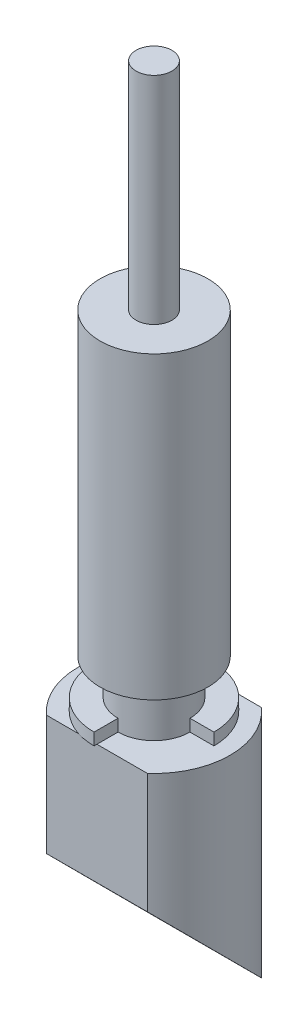
ISO-10303-21;
HEADER;
FILE_DESCRIPTION(('STEP AP214'),'2;1');
FILE_NAME('part.step','',(''),(''),'','','');
FILE_SCHEMA(('AUTOMOTIVE_DESIGN { 1 0 10303 214 1 1 1 1 }'));
ENDSEC;
DATA;
#1=APPLICATION_CONTEXT('core data for automotive mechanical design processes');
#2=APPLICATION_PROTOCOL_DEFINITION('international standard','automotive_design',2000,#1);
#3=PRODUCT_CONTEXT('',#1,'mechanical');
#4=PRODUCT('Part','Part','',(#3));
#5=PRODUCT_RELATED_PRODUCT_CATEGORY('part','',(#4));
#6=PRODUCT_DEFINITION_FORMATION('','',#4);
#7=PRODUCT_DEFINITION_CONTEXT('part definition',#1,'design');
#8=PRODUCT_DEFINITION('design','',#6,#7);
#9=PRODUCT_DEFINITION_SHAPE('','',#8);
#10=(LENGTH_UNIT() NAMED_UNIT(*) SI_UNIT(.MILLI.,.METRE.));
#11=(NAMED_UNIT(*) PLANE_ANGLE_UNIT() SI_UNIT($,.RADIAN.));
#12=(NAMED_UNIT(*) SI_UNIT($,.STERADIAN.) SOLID_ANGLE_UNIT());
#13=UNCERTAINTY_MEASURE_WITH_UNIT(LENGTH_MEASURE(1.E-05),#10,'distance_accuracy_value','');
#14=(GEOMETRIC_REPRESENTATION_CONTEXT(3) GLOBAL_UNCERTAINTY_ASSIGNED_CONTEXT((#13)) GLOBAL_UNIT_ASSIGNED_CONTEXT((#10,
#11,#12)) REPRESENTATION_CONTEXT('',''));
#15=CARTESIAN_POINT('',(0.,0.,0.));
#16=DIRECTION('',(0.,0.,1.));
#17=DIRECTION('',(1.,0.,0.));
#18=AXIS2_PLACEMENT_3D('',#15,#16,#17);
#19=CARTESIAN_POINT('',(0.,25.,0.));
#20=DIRECTION('',(0.,1.,0.));
#21=DIRECTION('',(0.,0.,1.));
#22=AXIS2_PLACEMENT_3D('',#19,#20,#21);
#23=PLANE('',#22);
#24=CARTESIAN_POINT('',(0.,25.,0.));
#25=DIRECTION('',(0.,1.,0.));
#26=DIRECTION('',(0.,0.,1.));
#27=AXIS2_PLACEMENT_3D('',#24,#25,#26);
#28=CIRCLE('',#27,4.5);
#29=CARTESIAN_POINT('',(0.,25.,4.5));
#30=VERTEX_POINT('',#29);
#31=EDGE_CURVE('E185',#30,#30,#28,.T.);
#32=ORIENTED_EDGE('',*,*,#31,.T.);
#33=EDGE_LOOP('',(#32));
#34=FACE_BOUND('',#33,.T.);
#35=CARTESIAN_POINT('',(0.,25.,0.));
#36=DIRECTION('',(0.,1.,0.));
#37=DIRECTION('',(0.,0.,1.));
#38=AXIS2_PLACEMENT_3D('',#35,#36,#37);
#39=CIRCLE('',#38,1.5);
#40=CARTESIAN_POINT('',(0.,25.,1.5));
#41=VERTEX_POINT('',#40);
#42=EDGE_CURVE('E387',#41,#41,#39,.T.);
#43=ORIENTED_EDGE('',*,*,#42,.F.);
#44=EDGE_LOOP('',(#43));
#45=FACE_BOUND('',#44,.T.);
#46=ADVANCED_FACE('F32',(#34,#45),#23,.T.);
#47=CARTESIAN_POINT('',(0.,-23.54,0.));
#48=DIRECTION('',(0.,1.,0.));
#49=DIRECTION('',(0.,0.,1.));
#50=AXIS2_PLACEMENT_3D('',#47,#48,#49);
#51=CYLINDRICAL_SURFACE('',#50,6.35);
#52=CARTESIAN_POINT('',(0.,-4.,0.));
#53=DIRECTION('',(0.,-1.,0.));
#54=DIRECTION('',(0.,0.,-1.));
#55=AXIS2_PLACEMENT_3D('',#52,#53,#54);
#56=CIRCLE('',#55,6.35);
#57=CARTESIAN_POINT('',(4.20296324038172,-4.,-4.76));
#58=VERTEX_POINT('',#57);
#59=CARTESIAN_POINT('',(4.20296324038172,-4.,4.76));
#60=VERTEX_POINT('',#59);
#61=EDGE_CURVE('E152',#58,#60,#56,.T.);
#62=ORIENTED_EDGE('',*,*,#61,.T.);
#63=DIRECTION('',(0.,1.,0.));
#64=VECTOR('',#63,1.);
#65=CARTESIAN_POINT('',(4.20296324038172,-23.54,4.76));
#66=LINE('',#65,#64);
#67=CARTESIAN_POINT('',(4.20296324038172,-14.,4.76));
#68=VERTEX_POINT('',#67);
#69=EDGE_CURVE('E47',#60,#68,#66,.F.);
#70=ORIENTED_EDGE('',*,*,#69,.T.);
#71=CARTESIAN_POINT('',(0.,-18.77,0.));
#72=DIRECTION('',(0.,0.706364412475623,-0.707848371325362));
#73=DIRECTION('',(0.,0.707848371325362,0.706364412475623));
#74=AXIS2_PLACEMENT_3D('',#71,#72,#73);
#75=ELLIPSE('',#74,8.98969411234196,6.35);
#76=CARTESIAN_POINT('',(4.20296324038172,-23.54,-4.76));
#77=VERTEX_POINT('',#76);
#78=EDGE_CURVE('E139',#68,#77,#75,.T.);
#79=ORIENTED_EDGE('',*,*,#78,.T.);
#80=DIRECTION('',(0.,1.,0.));
#81=VECTOR('',#80,1.);
#82=CARTESIAN_POINT('',(4.20296324038172,-23.54,-4.76));
#83=LINE('',#82,#81);
#84=EDGE_CURVE('E145',#77,#58,#83,.T.);
#85=ORIENTED_EDGE('',*,*,#84,.T.);
#86=EDGE_LOOP('',(#62,#70,#79,#85));
#87=FACE_BOUND('',#86,.T.);
#88=ADVANCED_FACE('F227',(#87),#51,.T.);
#89=CARTESIAN_POINT('',(0.,-4.,0.));
#90=DIRECTION('',(0.,-1.,0.));
#91=DIRECTION('',(0.,0.,-1.));
#92=AXIS2_PLACEMENT_3D('',#89,#90,#91);
#93=PLANE('',#92);
#94=ORIENTED_EDGE('',*,*,#61,.F.);
#95=DIRECTION('',(-1.,0.,0.));
#96=VECTOR('',#95,1.);
#97=CARTESIAN_POINT('',(0.,-4.,-4.76));
#98=LINE('',#97,#96);
#99=CARTESIAN_POINT('',(1.53049011757673,-4.,-4.76));
#100=VERTEX_POINT('',#99);
#101=EDGE_CURVE('E11',#58,#100,#98,.T.);
#102=ORIENTED_EDGE('',*,*,#101,.T.);
#103=CARTESIAN_POINT('',(0.,-4.,0.));
#104=DIRECTION('',(0.,-1.,0.));
#105=DIRECTION('',(0.,0.,-1.));
#106=AXIS2_PLACEMENT_3D('',#103,#104,#105);
#107=CIRCLE('',#106,5.);
#108=CARTESIAN_POINT('',(5.,-4.,0.));
#109=VERTEX_POINT('',#108);
#110=EDGE_CURVE('E155',#100,#109,#107,.T.);
#111=ORIENTED_EDGE('',*,*,#110,.T.);
#112=DIRECTION('',(-1.,0.,0.));
#113=VECTOR('',#112,1.);
#114=CARTESIAN_POINT('',(3.,-4.,0.));
#115=LINE('',#114,#113);
#116=CARTESIAN_POINT('',(3.,-4.,0.));
#117=VERTEX_POINT('',#116);
#118=EDGE_CURVE('E168',#109,#117,#115,.T.);
#119=ORIENTED_EDGE('',*,*,#118,.T.);
#120=CARTESIAN_POINT('',(0.,-4.,0.));
#121=DIRECTION('',(0.,-1.,0.));
#122=DIRECTION('',(0.,0.,-1.));
#123=AXIS2_PLACEMENT_3D('',#120,#121,#122);
#124=CIRCLE('',#123,3.);
#125=CARTESIAN_POINT('',(0.,-4.,3.));
#126=VERTEX_POINT('',#125);
#127=EDGE_CURVE('E175',#117,#126,#124,.T.);
#128=ORIENTED_EDGE('',*,*,#127,.T.);
#129=DIRECTION('',(0.,0.,1.));
#130=VECTOR('',#129,1.);
#131=CARTESIAN_POINT('',(0.,-4.,3.));
#132=LINE('',#131,#130);
#133=CARTESIAN_POINT('',(0.,-4.,4.76));
#134=VERTEX_POINT('',#133);
#135=EDGE_CURVE('E72',#126,#134,#132,.T.);
#136=ORIENTED_EDGE('',*,*,#135,.T.);
#137=DIRECTION('',(1.,0.,0.));
#138=VECTOR('',#137,1.);
#139=CARTESIAN_POINT('',(0.,-4.,4.76));
#140=LINE('',#139,#138);
#141=EDGE_CURVE('E192',#134,#60,#140,.T.);
#142=ORIENTED_EDGE('',*,*,#141,.T.);
#143=EDGE_LOOP('',(#94,#102,#111,#119,#128,#136,#142));
#144=FACE_BOUND('',#143,.T.);
#145=ADVANCED_FACE('F210',(#144),#93,.F.);
#146=CARTESIAN_POINT('',(0.,0.,0.));
#147=DIRECTION('',(0.,1.,0.));
#148=DIRECTION('',(0.,0.,1.));
#149=AXIS2_PLACEMENT_3D('',#146,#147,#148);
#150=PLANE('',#149);
#151=CARTESIAN_POINT('',(0.,0.,0.));
#152=DIRECTION('',(0.,1.,0.));
#153=DIRECTION('',(0.,0.,1.));
#154=AXIS2_PLACEMENT_3D('',#151,#152,#153);
#155=CIRCLE('',#154,4.5);
#156=CARTESIAN_POINT('',(0.,0.,4.5));
#157=VERTEX_POINT('',#156);
#158=EDGE_CURVE('E184',#157,#157,#155,.T.);
#159=ORIENTED_EDGE('',*,*,#158,.F.);
#160=EDGE_LOOP('',(#159));
#161=FACE_BOUND('',#160,.T.);
#162=CARTESIAN_POINT('',(0.,0.,0.));
#163=DIRECTION('',(0.,1.,0.));
#164=DIRECTION('',(0.,0.,1.));
#165=AXIS2_PLACEMENT_3D('',#162,#163,#164);
#166=CIRCLE('',#165,3.);
#167=CARTESIAN_POINT('',(0.,0.,3.));
#168=VERTEX_POINT('',#167);
#169=EDGE_CURVE('E188',#168,#168,#166,.F.);
#170=ORIENTED_EDGE('',*,*,#169,.F.);
#171=EDGE_LOOP('',(#170));
#172=FACE_BOUND('',#171,.T.);
#173=ADVANCED_FACE('F240',(#161,#172),#150,.F.);
#174=CARTESIAN_POINT('',(0.,25.,0.));
#175=DIRECTION('',(0.,-1.,0.));
#176=DIRECTION('',(0.,0.,-1.));
#177=AXIS2_PLACEMENT_3D('',#174,#175,#176);
#178=CYLINDRICAL_SURFACE('',#177,4.5);
#179=ORIENTED_EDGE('',*,*,#31,.F.);
#180=EDGE_LOOP('',(#179));
#181=FACE_BOUND('',#180,.T.);
#182=ORIENTED_EDGE('',*,*,#158,.T.);
#183=EDGE_LOOP('',(#182));
#184=FACE_BOUND('',#183,.T.);
#185=ADVANCED_FACE('F34',(#181,#184),#178,.T.);
#186=CARTESIAN_POINT('',(0.,-4.,0.));
#187=DIRECTION('',(0.,1.,0.));
#188=DIRECTION('',(0.,0.,1.));
#189=AXIS2_PLACEMENT_3D('',#186,#187,#188);
#190=CYLINDRICAL_SURFACE('',#189,3.);
#191=CARTESIAN_POINT('',(0.,-3.,0.));
#192=DIRECTION('',(0.,1.,0.));
#193=DIRECTION('',(0.,0.,-1.));
#194=AXIS2_PLACEMENT_3D('',#191,#192,#193);
#195=CIRCLE('',#194,3.);
#196=CARTESIAN_POINT('',(3.,-3.,0.));
#197=VERTEX_POINT('',#196);
#198=CARTESIAN_POINT('',(0.,-3.,3.));
#199=VERTEX_POINT('',#198);
#200=EDGE_CURVE('E160',#197,#199,#195,.T.);
#201=ORIENTED_EDGE('',*,*,#200,.T.);
#202=DIRECTION('',(0.,-1.,0.));
#203=VECTOR('',#202,1.);
#204=CARTESIAN_POINT('',(0.,-3.,3.));
#205=LINE('',#204,#203);
#206=EDGE_CURVE('E176',#199,#126,#205,.T.);
#207=ORIENTED_EDGE('',*,*,#206,.T.);
#208=ORIENTED_EDGE('',*,*,#127,.F.);
#209=DIRECTION('',(0.,-1.,0.));
#210=VECTOR('',#209,1.);
#211=CARTESIAN_POINT('',(3.,-3.,0.));
#212=LINE('',#211,#210);
#213=EDGE_CURVE('E178',#197,#117,#212,.T.);
#214=ORIENTED_EDGE('',*,*,#213,.F.);
#215=EDGE_LOOP('',(#201,#207,#208,#214));
#216=FACE_BOUND('',#215,.T.);
#217=ORIENTED_EDGE('',*,*,#169,.T.);
#218=EDGE_LOOP('',(#217));
#219=FACE_BOUND('',#218,.T.);
#220=ADVANCED_FACE('F214',(#216,#219),#190,.T.);
#221=CARTESIAN_POINT('',(0.,-3.,0.));
#222=DIRECTION('',(0.,-1.,0.));
#223=DIRECTION('',(0.,0.,-1.));
#224=AXIS2_PLACEMENT_3D('',#221,#222,#223);
#225=CYLINDRICAL_SURFACE('',#224,5.);
#226=CARTESIAN_POINT('',(0.,-4.,5.));
#227=VERTEX_POINT('',#226);
#228=CARTESIAN_POINT('',(-1.53049011757673,-4.,4.76));
#229=VERTEX_POINT('',#228);
#230=EDGE_CURVE('E166',#227,#229,#107,.T.);
#231=ORIENTED_EDGE('',*,*,#230,.F.);
#232=DIRECTION('',(0.,-1.,0.));
#233=VECTOR('',#232,1.);
#234=CARTESIAN_POINT('',(0.,-3.,5.));
#235=LINE('',#234,#233);
#236=CARTESIAN_POINT('',(0.,-3.,5.));
#237=VERTEX_POINT('',#236);
#238=EDGE_CURVE('E56',#237,#227,#235,.T.);
#239=ORIENTED_EDGE('',*,*,#238,.F.);
#240=CARTESIAN_POINT('',(0.,-3.,0.));
#241=DIRECTION('',(0.,-1.,0.));
#242=DIRECTION('',(0.,0.,-1.));
#243=AXIS2_PLACEMENT_3D('',#240,#241,#242);
#244=CIRCLE('',#243,5.);
#245=CARTESIAN_POINT('',(5.,-3.,0.));
#246=VERTEX_POINT('',#245);
#247=EDGE_CURVE('E156',#237,#246,#244,.T.);
#248=ORIENTED_EDGE('',*,*,#247,.T.);
#249=DIRECTION('',(0.,-1.,0.));
#250=VECTOR('',#249,1.);
#251=CARTESIAN_POINT('',(5.,-3.,0.));
#252=LINE('',#251,#250);
#253=EDGE_CURVE('E80',#246,#109,#252,.T.);
#254=ORIENTED_EDGE('',*,*,#253,.T.);
#255=ORIENTED_EDGE('',*,*,#110,.F.);
#256=CARTESIAN_POINT('',(-1.53049011757673,-4.,-4.76));
#257=VERTEX_POINT('',#256);
#258=EDGE_CURVE('E207',#257,#100,#107,.T.);
#259=ORIENTED_EDGE('',*,*,#258,.F.);
#260=EDGE_CURVE('E169',#229,#257,#107,.T.);
#261=ORIENTED_EDGE('',*,*,#260,.F.);
#262=EDGE_LOOP('',(#231,#239,#248,#254,#255,#259,#261));
#263=FACE_BOUND('',#262,.T.);
#264=ADVANCED_FACE('F208',(#263),#225,.T.);
#265=CARTESIAN_POINT('',(0.,-3.,3.));
#266=DIRECTION('',(1.,0.,0.));
#267=DIRECTION('',(0.,0.,-1.));
#268=AXIS2_PLACEMENT_3D('',#265,#266,#267);
#269=PLANE('',#268);
#270=ORIENTED_EDGE('',*,*,#135,.F.);
#271=ORIENTED_EDGE('',*,*,#206,.F.);
#272=DIRECTION('',(0.,0.,1.));
#273=VECTOR('',#272,1.);
#274=CARTESIAN_POINT('',(0.,-3.,3.));
#275=LINE('',#274,#273);
#276=EDGE_CURVE('E163',#199,#237,#275,.T.);
#277=ORIENTED_EDGE('',*,*,#276,.T.);
#278=ORIENTED_EDGE('',*,*,#238,.T.);
#279=EDGE_CURVE('E172',#134,#227,#132,.T.);
#280=ORIENTED_EDGE('',*,*,#279,.F.);
#281=EDGE_LOOP('',(#270,#271,#277,#278,#280));
#282=FACE_BOUND('',#281,.T.);
#283=ADVANCED_FACE('F217',(#282),#269,.T.);
#284=CARTESIAN_POINT('',(3.,-3.,0.));
#285=DIRECTION('',(0.,0.,1.));
#286=DIRECTION('',(1.,0.,0.));
#287=AXIS2_PLACEMENT_3D('',#284,#285,#286);
#288=PLANE('',#287);
#289=ORIENTED_EDGE('',*,*,#118,.F.);
#290=ORIENTED_EDGE('',*,*,#253,.F.);
#291=DIRECTION('',(-1.,0.,0.));
#292=VECTOR('',#291,1.);
#293=CARTESIAN_POINT('',(3.,-3.,0.));
#294=LINE('',#293,#292);
#295=EDGE_CURVE('E158',#246,#197,#294,.T.);
#296=ORIENTED_EDGE('',*,*,#295,.T.);
#297=ORIENTED_EDGE('',*,*,#213,.T.);
#298=EDGE_LOOP('',(#289,#290,#296,#297));
#299=FACE_BOUND('',#298,.T.);
#300=ADVANCED_FACE('F211',(#299),#288,.T.);
#301=CARTESIAN_POINT('',(0.,-3.,0.));
#302=DIRECTION('',(0.,-1.,0.));
#303=DIRECTION('',(0.,0.,-1.));
#304=AXIS2_PLACEMENT_3D('',#301,#302,#303);
#305=PLANE('',#304);
#306=ORIENTED_EDGE('',*,*,#247,.F.);
#307=ORIENTED_EDGE('',*,*,#276,.F.);
#308=ORIENTED_EDGE('',*,*,#200,.F.);
#309=ORIENTED_EDGE('',*,*,#295,.F.);
#310=EDGE_LOOP('',(#306,#307,#308,#309));
#311=FACE_BOUND('',#310,.T.);
#312=ADVANCED_FACE('F219',(#311),#305,.F.);
#313=CARTESIAN_POINT('',(-4.20296324038172,-4.,4.76));
#314=VERTEX_POINT('',#313);
#315=CARTESIAN_POINT('',(-4.20296324038172,-4.,-4.76));
#316=VERTEX_POINT('',#315);
#317=EDGE_CURVE('E147',#314,#316,#56,.T.);
#318=ORIENTED_EDGE('',*,*,#317,.T.);
#319=DIRECTION('',(0.,1.,0.));
#320=VECTOR('',#319,1.);
#321=CARTESIAN_POINT('',(-4.20296324038172,-23.54,-4.76));
#322=LINE('',#321,#320);
#323=CARTESIAN_POINT('',(-4.20296324038172,-23.54,-4.76));
#324=VERTEX_POINT('',#323);
#325=EDGE_CURVE('E132',#316,#324,#322,.F.);
#326=ORIENTED_EDGE('',*,*,#325,.T.);
#327=CARTESIAN_POINT('',(-4.20296324038172,-14.,4.76));
#328=VERTEX_POINT('',#327);
#329=EDGE_CURVE('E137',#324,#328,#75,.T.);
#330=ORIENTED_EDGE('',*,*,#329,.T.);
#331=DIRECTION('',(0.,1.,0.));
#332=VECTOR('',#331,1.);
#333=CARTESIAN_POINT('',(-4.20296324038172,-23.54,4.76));
#334=LINE('',#333,#332);
#335=EDGE_CURVE('E121',#328,#314,#334,.T.);
#336=ORIENTED_EDGE('',*,*,#335,.T.);
#337=EDGE_LOOP('',(#318,#326,#330,#336));
#338=FACE_BOUND('',#337,.T.);
#339=ADVANCED_FACE('F144',(#338),#51,.T.);
#340=ORIENTED_EDGE('',*,*,#260,.T.);
#341=EDGE_CURVE('E36',#257,#316,#98,.T.);
#342=ORIENTED_EDGE('',*,*,#341,.T.);
#343=ORIENTED_EDGE('',*,*,#317,.F.);
#344=EDGE_CURVE('E127',#314,#229,#140,.T.);
#345=ORIENTED_EDGE('',*,*,#344,.T.);
#346=EDGE_LOOP('',(#340,#342,#343,#345));
#347=FACE_BOUND('',#346,.T.);
#348=ADVANCED_FACE('F200',(#347),#93,.F.);
#349=CARTESIAN_POINT('',(-13.19,-4.,-4.76));
#350=DIRECTION('',(0.,1.,0.));
#351=DIRECTION('',(0.,0.,1.));
#352=AXIS2_PLACEMENT_3D('',#349,#350,#351);
#353=PLANE('',#352);
#354=ORIENTED_EDGE('',*,*,#258,.T.);
#355=DIRECTION('',(1.,0.,0.));
#356=VECTOR('',#355,1.);
#357=CARTESIAN_POINT('',(-13.19,-4.,-4.76));
#358=LINE('',#357,#356);
#359=EDGE_CURVE('E205',#257,#100,#358,.T.);
#360=ORIENTED_EDGE('',*,*,#359,.F.);
#361=EDGE_LOOP('',(#354,#360));
#362=FACE_BOUND('',#361,.T.);
#363=ADVANCED_FACE('F316',(#362),#353,.F.);
#364=CARTESIAN_POINT('',(-13.19,-4.,8.9675760242674));
#365=DIRECTION('',(0.,1.,0.));
#366=DIRECTION('',(0.,0.,1.));
#367=AXIS2_PLACEMENT_3D('',#364,#365,#366);
#368=PLANE('',#367);
#369=ORIENTED_EDGE('',*,*,#230,.T.);
#370=DIRECTION('',(1.,0.,0.));
#371=VECTOR('',#370,1.);
#372=CARTESIAN_POINT('',(-13.19,-4.,4.76));
#373=LINE('',#372,#371);
#374=EDGE_CURVE('E140',#229,#134,#373,.T.);
#375=ORIENTED_EDGE('',*,*,#374,.T.);
#376=ORIENTED_EDGE('',*,*,#279,.T.);
#377=EDGE_LOOP('',(#369,#375,#376));
#378=FACE_BOUND('',#377,.T.);
#379=ADVANCED_FACE('F323',(#378),#368,.F.);
#380=CARTESIAN_POINT('',(-13.19,-23.54,-4.76));
#381=DIRECTION('',(0.,0.706364412475623,-0.707848371325362));
#382=DIRECTION('',(0.,0.707848371325362,0.706364412475623));
#383=AXIS2_PLACEMENT_3D('',#380,#381,#382);
#384=PLANE('',#383);
#385=DIRECTION('',(1.,0.,0.));
#386=VECTOR('',#385,1.);
#387=CARTESIAN_POINT('',(-13.19,-14.,4.76));
#388=LINE('',#387,#386);
#389=EDGE_CURVE('E124',#328,#68,#388,.T.);
#390=ORIENTED_EDGE('',*,*,#389,.F.);
#391=ORIENTED_EDGE('',*,*,#329,.F.);
#392=DIRECTION('',(1.,0.,0.));
#393=VECTOR('',#392,1.);
#394=CARTESIAN_POINT('',(-13.19,-23.54,-4.76));
#395=LINE('',#394,#393);
#396=EDGE_CURVE('E141',#324,#77,#395,.T.);
#397=ORIENTED_EDGE('',*,*,#396,.T.);
#398=ORIENTED_EDGE('',*,*,#78,.F.);
#399=EDGE_LOOP('',(#390,#391,#397,#398));
#400=FACE_BOUND('',#399,.T.);
#401=ADVANCED_FACE('F135',(#400),#384,.F.);
#402=CARTESIAN_POINT('',(-13.19,-4.,-4.76));
#403=DIRECTION('',(0.,0.,1.));
#404=DIRECTION('',(0.,-1.,0.));
#405=AXIS2_PLACEMENT_3D('',#402,#403,#404);
#406=PLANE('',#405);
#407=ORIENTED_EDGE('',*,*,#396,.F.);
#408=ORIENTED_EDGE('',*,*,#325,.F.);
#409=ORIENTED_EDGE('',*,*,#341,.F.);
#410=ORIENTED_EDGE('',*,*,#359,.T.);
#411=ORIENTED_EDGE('',*,*,#101,.F.);
#412=ORIENTED_EDGE('',*,*,#84,.F.);
#413=EDGE_LOOP('',(#407,#408,#409,#410,#411,#412));
#414=FACE_BOUND('',#413,.T.);
#415=ADVANCED_FACE('F204',(#414),#406,.F.);
#416=CARTESIAN_POINT('',(-13.19,-14.,4.76));
#417=DIRECTION('',(0.,0.,-1.));
#418=DIRECTION('',(0.,1.,0.));
#419=AXIS2_PLACEMENT_3D('',#416,#417,#418);
#420=PLANE('',#419);
#421=ORIENTED_EDGE('',*,*,#389,.T.);
#422=ORIENTED_EDGE('',*,*,#69,.F.);
#423=ORIENTED_EDGE('',*,*,#141,.F.);
#424=ORIENTED_EDGE('',*,*,#374,.F.);
#425=ORIENTED_EDGE('',*,*,#344,.F.);
#426=ORIENTED_EDGE('',*,*,#335,.F.);
#427=EDGE_LOOP('',(#421,#422,#423,#424,#425,#426));
#428=FACE_BOUND('',#427,.T.);
#429=ADVANCED_FACE('F123',(#428),#420,.F.);
#430=CARTESIAN_POINT('',(0.,43.,0.));
#431=DIRECTION('',(0.,-1.,0.));
#432=DIRECTION('',(0.,0.,-1.));
#433=AXIS2_PLACEMENT_3D('',#430,#431,#432);
#434=CYLINDRICAL_SURFACE('',#433,1.5);
#435=CARTESIAN_POINT('',(0.,43.,0.));
#436=DIRECTION('',(0.,1.,0.));
#437=DIRECTION('',(0.,0.,1.));
#438=AXIS2_PLACEMENT_3D('',#435,#436,#437);
#439=CIRCLE('',#438,1.5);
#440=CARTESIAN_POINT('',(0.,43.,1.5));
#441=VERTEX_POINT('',#440);
#442=EDGE_CURVE('E386',#441,#441,#439,.T.);
#443=ORIENTED_EDGE('',*,*,#442,.F.);
#444=EDGE_LOOP('',(#443));
#445=FACE_BOUND('',#444,.T.);
#446=ORIENTED_EDGE('',*,*,#42,.T.);
#447=EDGE_LOOP('',(#446));
#448=FACE_BOUND('',#447,.T.);
#449=ADVANCED_FACE('F356',(#445,#448),#434,.T.);
#450=CARTESIAN_POINT('',(0.,43.,0.));
#451=DIRECTION('',(0.,1.,0.));
#452=DIRECTION('',(0.,0.,1.));
#453=AXIS2_PLACEMENT_3D('',#450,#451,#452);
#454=PLANE('',#453);
#455=ORIENTED_EDGE('',*,*,#442,.T.);
#456=EDGE_LOOP('',(#455));
#457=FACE_BOUND('',#456,.T.);
#458=ADVANCED_FACE('F370',(#457),#454,.T.);
#459=CLOSED_SHELL('',(#46,#88,#145,#173,#185,#220,#264,#283,#300,#312,#339,#348,#363,#379,#401,
#415,#429,#449,#458));
#460=MANIFOLD_SOLID_BREP('B2',#459);
#461=ADVANCED_BREP_SHAPE_REPRESENTATION('',(#18,#460),#14);
#462=SHAPE_DEFINITION_REPRESENTATION(#9,#461);
ENDSEC;
END-ISO-10303-21;
